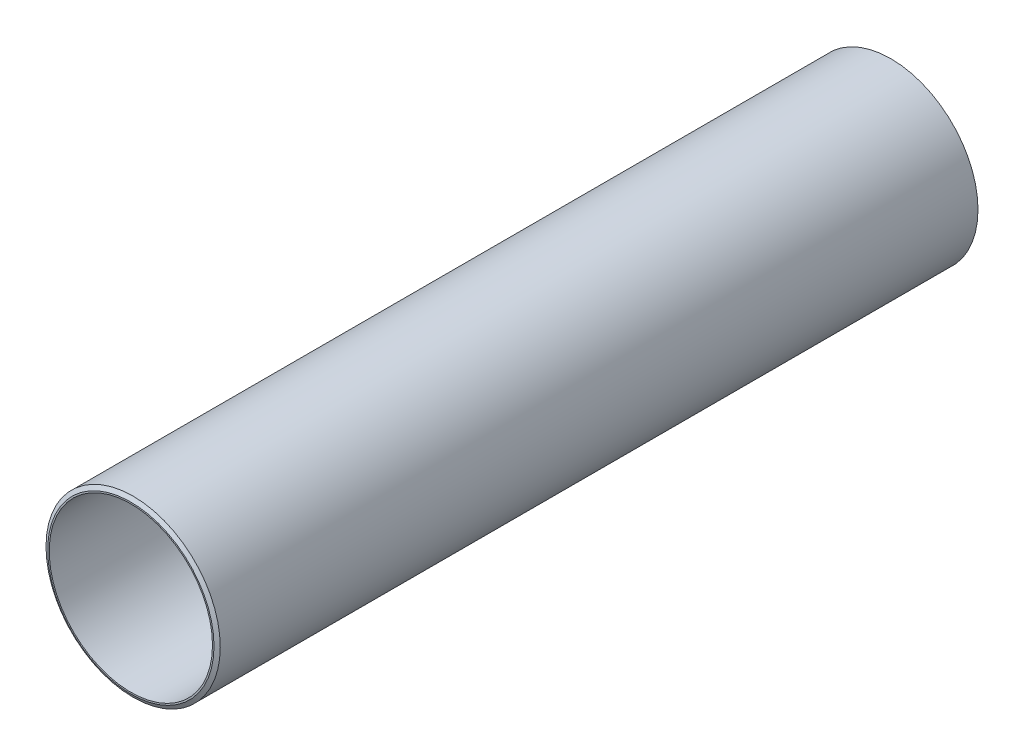
ISO-10303-21;
HEADER;
FILE_DESCRIPTION(('STEP AP214'),'2;1');
FILE_NAME('part.step','',(''),(''),'','','');
FILE_SCHEMA(('AUTOMOTIVE_DESIGN { 1 0 10303 214 1 1 1 1 }'));
ENDSEC;
DATA;
#1=APPLICATION_CONTEXT('core data for automotive mechanical design processes');
#2=APPLICATION_PROTOCOL_DEFINITION('international standard','automotive_design',2000,#1);
#3=PRODUCT_CONTEXT('',#1,'mechanical');
#4=PRODUCT('Part','Part','',(#3));
#5=PRODUCT_RELATED_PRODUCT_CATEGORY('part','',(#4));
#6=PRODUCT_DEFINITION_FORMATION('','',#4);
#7=PRODUCT_DEFINITION_CONTEXT('part definition',#1,'design');
#8=PRODUCT_DEFINITION('design','',#6,#7);
#9=PRODUCT_DEFINITION_SHAPE('','',#8);
#10=(LENGTH_UNIT() NAMED_UNIT(*) SI_UNIT(.MILLI.,.METRE.));
#11=(NAMED_UNIT(*) PLANE_ANGLE_UNIT() SI_UNIT($,.RADIAN.));
#12=(NAMED_UNIT(*) SI_UNIT($,.STERADIAN.) SOLID_ANGLE_UNIT());
#13=UNCERTAINTY_MEASURE_WITH_UNIT(LENGTH_MEASURE(1.E-05),#10,'distance_accuracy_value','');
#14=(GEOMETRIC_REPRESENTATION_CONTEXT(3) GLOBAL_UNCERTAINTY_ASSIGNED_CONTEXT((#13)) GLOBAL_UNIT_ASSIGNED_CONTEXT((#10,
#11,#12)) REPRESENTATION_CONTEXT('',''));
#15=CARTESIAN_POINT('',(0.,0.,0.));
#16=DIRECTION('',(0.,0.,1.));
#17=DIRECTION('',(1.,0.,0.));
#18=AXIS2_PLACEMENT_3D('',#15,#16,#17);
#19=CARTESIAN_POINT('',(0.,0.,250.));
#20=DIRECTION('',(0.,0.,-1.));
#21=DIRECTION('',(-1.,0.,0.));
#22=AXIS2_PLACEMENT_3D('',#19,#20,#21);
#23=CYLINDRICAL_SURFACE('',#22,57.15);
#24=CARTESIAN_POINT('',(0.,0.,248.498889300107));
#25=DIRECTION('',(0.,0.,1.));
#26=DIRECTION('',(1.,0.,0.));
#27=AXIS2_PLACEMENT_3D('',#24,#25,#26);
#28=CIRCLE('',#27,57.15);
#29=CARTESIAN_POINT('',(57.15,0.,248.498889300107));
#30=VERTEX_POINT('',#29);
#31=EDGE_CURVE('E41',#30,#30,#28,.T.);
#32=ORIENTED_EDGE('',*,*,#31,.F.);
#33=EDGE_LOOP('',(#32));
#34=FACE_BOUND('',#33,.T.);
#35=CARTESIAN_POINT('',(0.,0.,-248.498889300107));
#36=DIRECTION('',(0.,0.,1.));
#37=DIRECTION('',(1.,0.,0.));
#38=AXIS2_PLACEMENT_3D('',#35,#36,#37);
#39=CIRCLE('',#38,57.15);
#40=CARTESIAN_POINT('',(57.15,0.,-248.498889300107));
#41=VERTEX_POINT('',#40);
#42=EDGE_CURVE('E48',#41,#41,#39,.T.);
#43=ORIENTED_EDGE('',*,*,#42,.T.);
#44=EDGE_LOOP('',(#43));
#45=FACE_BOUND('',#44,.T.);
#46=ADVANCED_FACE('F31',(#34,#45),#23,.T.);
#47=CARTESIAN_POINT('',(0.,0.,-250.));
#48=DIRECTION('',(0.,0.,1.));
#49=DIRECTION('',(1.,0.,0.));
#50=AXIS2_PLACEMENT_3D('',#47,#48,#49);
#51=PLANE('',#50);
#52=CARTESIAN_POINT('',(0.,0.,-250.));
#53=DIRECTION('',(0.,0.,1.));
#54=DIRECTION('',(1.,0.,0.));
#55=AXIS2_PLACEMENT_3D('',#52,#53,#54);
#56=CIRCLE('',#55,53.55);
#57=CARTESIAN_POINT('',(53.55,0.,-250.));
#58=VERTEX_POINT('',#57);
#59=EDGE_CURVE('E34',#58,#58,#56,.T.);
#60=ORIENTED_EDGE('',*,*,#59,.T.);
#61=EDGE_LOOP('',(#60));
#62=FACE_BOUND('',#61,.T.);
#63=CARTESIAN_POINT('',(0.,0.,-250.));
#64=DIRECTION('',(0.,0.,1.));
#65=DIRECTION('',(1.,0.,0.));
#66=AXIS2_PLACEMENT_3D('',#63,#64,#65);
#67=CIRCLE('',#66,54.55);
#68=CARTESIAN_POINT('',(54.55,0.,-250.));
#69=VERTEX_POINT('',#68);
#70=EDGE_CURVE('E51',#69,#69,#67,.T.);
#71=ORIENTED_EDGE('',*,*,#70,.F.);
#72=EDGE_LOOP('',(#71));
#73=FACE_BOUND('',#72,.T.);
#74=ADVANCED_FACE('F58',(#62,#73),#51,.F.);
#75=CARTESIAN_POINT('',(0.,0.,250.));
#76=DIRECTION('',(0.,0.,1.));
#77=DIRECTION('',(1.,0.,0.));
#78=AXIS2_PLACEMENT_3D('',#75,#76,#77);
#79=PLANE('',#78);
#80=CARTESIAN_POINT('',(0.,0.,250.));
#81=DIRECTION('',(0.,0.,1.));
#82=DIRECTION('',(1.,0.,0.));
#83=AXIS2_PLACEMENT_3D('',#80,#81,#82);
#84=CIRCLE('',#83,53.55);
#85=CARTESIAN_POINT('',(53.55,0.,250.));
#86=VERTEX_POINT('',#85);
#87=EDGE_CURVE('E10',#86,#86,#84,.T.);
#88=ORIENTED_EDGE('',*,*,#87,.F.);
#89=EDGE_LOOP('',(#88));
#90=FACE_BOUND('',#89,.T.);
#91=CARTESIAN_POINT('',(0.,0.,250.));
#92=DIRECTION('',(0.,0.,1.));
#93=DIRECTION('',(1.,0.,0.));
#94=AXIS2_PLACEMENT_3D('',#91,#92,#93);
#95=CIRCLE('',#94,54.55);
#96=CARTESIAN_POINT('',(54.55,0.,250.));
#97=VERTEX_POINT('',#96);
#98=EDGE_CURVE('E45',#97,#97,#95,.T.);
#99=ORIENTED_EDGE('',*,*,#98,.T.);
#100=EDGE_LOOP('',(#99));
#101=FACE_BOUND('',#100,.T.);
#102=ADVANCED_FACE('F60',(#90,#101),#79,.T.);
#103=CARTESIAN_POINT('',(0.,0.,250.));
#104=DIRECTION('',(0.,0.,-1.));
#105=DIRECTION('',(-1.,0.,0.));
#106=AXIS2_PLACEMENT_3D('',#103,#104,#105);
#107=CYLINDRICAL_SURFACE('',#106,53.55);
#108=ORIENTED_EDGE('',*,*,#87,.T.);
#109=EDGE_LOOP('',(#108));
#110=FACE_BOUND('',#109,.T.);
#111=ORIENTED_EDGE('',*,*,#59,.F.);
#112=EDGE_LOOP('',(#111));
#113=FACE_BOUND('',#112,.T.);
#114=ADVANCED_FACE('F66',(#110,#113),#107,.F.);
#115=CARTESIAN_POINT('',(0.,0.,250.));
#116=DIRECTION('',(0.,0.,-1.));
#117=DIRECTION('',(-1.,0.,0.));
#118=AXIS2_PLACEMENT_3D('',#115,#116,#117);
#119=CONICAL_SURFACE('',#118,54.55,1.0471975511966);
#120=ORIENTED_EDGE('',*,*,#31,.T.);
#121=EDGE_LOOP('',(#120));
#122=FACE_BOUND('',#121,.T.);
#123=ORIENTED_EDGE('',*,*,#98,.F.);
#124=EDGE_LOOP('',(#123));
#125=FACE_BOUND('',#124,.T.);
#126=ADVANCED_FACE('F73',(#122,#125),#119,.T.);
#127=CARTESIAN_POINT('',(0.,0.,-248.498889300107));
#128=DIRECTION('',(0.,0.,1.));
#129=DIRECTION('',(1.,0.,0.));
#130=AXIS2_PLACEMENT_3D('',#127,#128,#129);
#131=CONICAL_SURFACE('',#130,57.15,1.04719755119661);
#132=ORIENTED_EDGE('',*,*,#70,.T.);
#133=EDGE_LOOP('',(#132));
#134=FACE_BOUND('',#133,.T.);
#135=ORIENTED_EDGE('',*,*,#42,.F.);
#136=EDGE_LOOP('',(#135));
#137=FACE_BOUND('',#136,.T.);
#138=ADVANCED_FACE('F55',(#134,#137),#131,.T.);
#139=CLOSED_SHELL('',(#46,#74,#102,#114,#126,#138));
#140=MANIFOLD_SOLID_BREP('B2',#139);
#141=ADVANCED_BREP_SHAPE_REPRESENTATION('',(#18,#140),#14);
#142=SHAPE_DEFINITION_REPRESENTATION(#9,#141);
ENDSEC;
END-ISO-10303-21;
